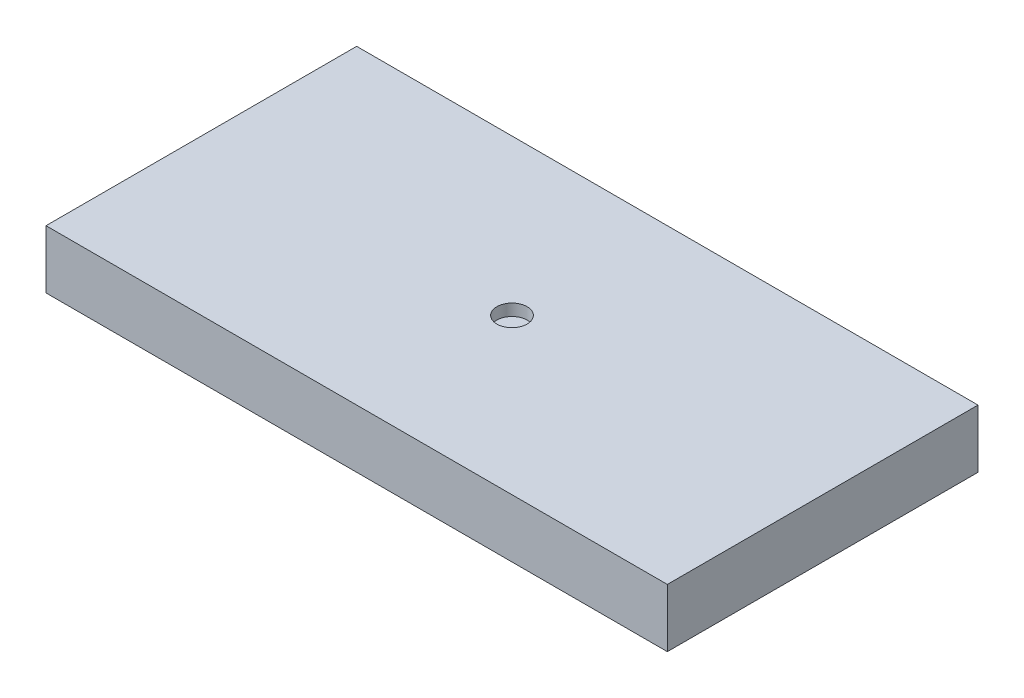
ISO-10303-21;
HEADER;
FILE_DESCRIPTION(('STEP AP214'),'2;1');
FILE_NAME('part.step','',(''),(''),'','','');
FILE_SCHEMA(('AUTOMOTIVE_DESIGN { 1 0 10303 214 1 1 1 1 }'));
ENDSEC;
DATA;
#1=APPLICATION_CONTEXT('core data for automotive mechanical design processes');
#2=APPLICATION_PROTOCOL_DEFINITION('international standard','automotive_design',2000,#1);
#3=PRODUCT_CONTEXT('',#1,'mechanical');
#4=PRODUCT('Part','Part','',(#3));
#5=PRODUCT_RELATED_PRODUCT_CATEGORY('part','',(#4));
#6=PRODUCT_DEFINITION_FORMATION('','',#4);
#7=PRODUCT_DEFINITION_CONTEXT('part definition',#1,'design');
#8=PRODUCT_DEFINITION('design','',#6,#7);
#9=PRODUCT_DEFINITION_SHAPE('','',#8);
#10=(LENGTH_UNIT() NAMED_UNIT(*) SI_UNIT(.MILLI.,.METRE.));
#11=(NAMED_UNIT(*) PLANE_ANGLE_UNIT() SI_UNIT($,.RADIAN.));
#12=(NAMED_UNIT(*) SI_UNIT($,.STERADIAN.) SOLID_ANGLE_UNIT());
#13=UNCERTAINTY_MEASURE_WITH_UNIT(LENGTH_MEASURE(1.E-05),#10,'distance_accuracy_value','');
#14=(GEOMETRIC_REPRESENTATION_CONTEXT(3) GLOBAL_UNCERTAINTY_ASSIGNED_CONTEXT((#13)) GLOBAL_UNIT_ASSIGNED_CONTEXT((#10,
#11,#12)) REPRESENTATION_CONTEXT('',''));
#15=CARTESIAN_POINT('',(0.,0.,0.));
#16=DIRECTION('',(0.,0.,1.));
#17=DIRECTION('',(1.,0.,0.));
#18=AXIS2_PLACEMENT_3D('',#15,#16,#17);
#19=CARTESIAN_POINT('',(20.32,3.81,10.16));
#20=DIRECTION('',(-1.,0.,0.));
#21=DIRECTION('',(0.,0.,1.));
#22=AXIS2_PLACEMENT_3D('',#19,#20,#21);
#23=PLANE('',#22);
#24=DIRECTION('',(0.,0.,-1.));
#25=VECTOR('',#24,1.);
#26=CARTESIAN_POINT('',(20.32,0.,10.16));
#27=LINE('',#26,#25);
#28=CARTESIAN_POINT('',(20.32,0.,10.16));
#29=VERTEX_POINT('',#28);
#30=CARTESIAN_POINT('',(20.32,0.,-10.16));
#31=VERTEX_POINT('',#30);
#32=EDGE_CURVE('E98',#29,#31,#27,.T.);
#33=ORIENTED_EDGE('',*,*,#32,.T.);
#34=DIRECTION('',(0.,-1.,0.));
#35=VECTOR('',#34,1.);
#36=CARTESIAN_POINT('',(20.32,3.81,-10.16));
#37=LINE('',#36,#35);
#38=CARTESIAN_POINT('',(20.32,3.81,-10.16));
#39=VERTEX_POINT('',#38);
#40=EDGE_CURVE('E11',#39,#31,#37,.T.);
#41=ORIENTED_EDGE('',*,*,#40,.F.);
#42=DIRECTION('',(0.,0.,-1.));
#43=VECTOR('',#42,1.);
#44=CARTESIAN_POINT('',(20.32,3.81,10.16));
#45=LINE('',#44,#43);
#46=CARTESIAN_POINT('',(20.32,3.81,10.16));
#47=VERTEX_POINT('',#46);
#48=EDGE_CURVE('E86',#47,#39,#45,.T.);
#49=ORIENTED_EDGE('',*,*,#48,.F.);
#50=DIRECTION('',(0.,-1.,0.));
#51=VECTOR('',#50,1.);
#52=CARTESIAN_POINT('',(20.32,3.81,10.16));
#53=LINE('',#52,#51);
#54=EDGE_CURVE('E94',#47,#29,#53,.T.);
#55=ORIENTED_EDGE('',*,*,#54,.T.);
#56=EDGE_LOOP('',(#33,#41,#49,#55));
#57=FACE_BOUND('',#56,.T.);
#58=ADVANCED_FACE('F35',(#57),#23,.F.);
#59=CARTESIAN_POINT('',(-20.32,3.81,-10.16));
#60=DIRECTION('',(0.,0.,1.));
#61=DIRECTION('',(1.,0.,0.));
#62=AXIS2_PLACEMENT_3D('',#59,#60,#61);
#63=PLANE('',#62);
#64=DIRECTION('',(-1.,0.,0.));
#65=VECTOR('',#64,1.);
#66=CARTESIAN_POINT('',(-20.32,0.,-10.16));
#67=LINE('',#66,#65);
#68=CARTESIAN_POINT('',(-20.32,0.,-10.16));
#69=VERTEX_POINT('',#68);
#70=EDGE_CURVE('E90',#31,#69,#67,.T.);
#71=ORIENTED_EDGE('',*,*,#70,.T.);
#72=DIRECTION('',(0.,-1.,0.));
#73=VECTOR('',#72,1.);
#74=CARTESIAN_POINT('',(-20.32,3.81,-10.16));
#75=LINE('',#74,#73);
#76=CARTESIAN_POINT('',(-20.32,3.81,-10.16));
#77=VERTEX_POINT('',#76);
#78=EDGE_CURVE('E43',#77,#69,#75,.T.);
#79=ORIENTED_EDGE('',*,*,#78,.F.);
#80=DIRECTION('',(-1.,0.,0.));
#81=VECTOR('',#80,1.);
#82=CARTESIAN_POINT('',(-20.32,3.81,-10.16));
#83=LINE('',#82,#81);
#84=EDGE_CURVE('E81',#39,#77,#83,.T.);
#85=ORIENTED_EDGE('',*,*,#84,.F.);
#86=ORIENTED_EDGE('',*,*,#40,.T.);
#87=EDGE_LOOP('',(#71,#79,#85,#86));
#88=FACE_BOUND('',#87,.T.);
#89=ADVANCED_FACE('F89',(#88),#63,.F.);
#90=CARTESIAN_POINT('',(-20.32,3.81,10.16));
#91=DIRECTION('',(1.,0.,0.));
#92=DIRECTION('',(0.,0.,-1.));
#93=AXIS2_PLACEMENT_3D('',#90,#91,#92);
#94=PLANE('',#93);
#95=DIRECTION('',(0.,0.,1.));
#96=VECTOR('',#95,1.);
#97=CARTESIAN_POINT('',(-20.32,0.,10.16));
#98=LINE('',#97,#96);
#99=CARTESIAN_POINT('',(-20.32,0.,10.16));
#100=VERTEX_POINT('',#99);
#101=EDGE_CURVE('E68',#69,#100,#98,.T.);
#102=ORIENTED_EDGE('',*,*,#101,.T.);
#103=DIRECTION('',(0.,-1.,0.));
#104=VECTOR('',#103,1.);
#105=CARTESIAN_POINT('',(-20.32,3.81,10.16));
#106=LINE('',#105,#104);
#107=CARTESIAN_POINT('',(-20.32,3.81,10.16));
#108=VERTEX_POINT('',#107);
#109=EDGE_CURVE('E91',#108,#100,#106,.T.);
#110=ORIENTED_EDGE('',*,*,#109,.F.);
#111=DIRECTION('',(0.,0.,1.));
#112=VECTOR('',#111,1.);
#113=CARTESIAN_POINT('',(-20.32,3.81,10.16));
#114=LINE('',#113,#112);
#115=EDGE_CURVE('E84',#77,#108,#114,.T.);
#116=ORIENTED_EDGE('',*,*,#115,.F.);
#117=ORIENTED_EDGE('',*,*,#78,.T.);
#118=EDGE_LOOP('',(#102,#110,#116,#117));
#119=FACE_BOUND('',#118,.T.);
#120=ADVANCED_FACE('F92',(#119),#94,.F.);
#121=CARTESIAN_POINT('',(-20.32,3.81,10.16));
#122=DIRECTION('',(0.,0.,-1.));
#123=DIRECTION('',(-1.,0.,0.));
#124=AXIS2_PLACEMENT_3D('',#121,#122,#123);
#125=PLANE('',#124);
#126=DIRECTION('',(1.,0.,0.));
#127=VECTOR('',#126,1.);
#128=CARTESIAN_POINT('',(-20.32,0.,10.16));
#129=LINE('',#128,#127);
#130=EDGE_CURVE('E74',#100,#29,#129,.T.);
#131=ORIENTED_EDGE('',*,*,#130,.T.);
#132=ORIENTED_EDGE('',*,*,#54,.F.);
#133=DIRECTION('',(1.,0.,0.));
#134=VECTOR('',#133,1.);
#135=CARTESIAN_POINT('',(-20.32,3.81,10.16));
#136=LINE('',#135,#134);
#137=EDGE_CURVE('E51',#108,#47,#136,.T.);
#138=ORIENTED_EDGE('',*,*,#137,.F.);
#139=ORIENTED_EDGE('',*,*,#109,.T.);
#140=EDGE_LOOP('',(#131,#132,#138,#139));
#141=FACE_BOUND('',#140,.T.);
#142=ADVANCED_FACE('F106',(#141),#125,.F.);
#143=CARTESIAN_POINT('',(0.,3.81,0.));
#144=DIRECTION('',(0.,-1.,0.));
#145=DIRECTION('',(0.,0.,-1.));
#146=AXIS2_PLACEMENT_3D('',#143,#144,#145);
#147=PLANE('',#146);
#148=CARTESIAN_POINT('',(0.,3.81,0.));
#149=DIRECTION('',(0.,1.,0.));
#150=DIRECTION('',(0.,0.,1.));
#151=AXIS2_PLACEMENT_3D('',#148,#149,#150);
#152=CIRCLE('',#151,0.988166538320456);
#153=CARTESIAN_POINT('',(0.,3.81,0.988166538320456));
#154=VERTEX_POINT('',#153);
#155=EDGE_CURVE('E112',#154,#154,#152,.T.);
#156=ORIENTED_EDGE('',*,*,#155,.F.);
#157=EDGE_LOOP('',(#156));
#158=FACE_BOUND('',#157,.T.);
#159=ORIENTED_EDGE('',*,*,#48,.T.);
#160=ORIENTED_EDGE('',*,*,#84,.T.);
#161=ORIENTED_EDGE('',*,*,#115,.T.);
#162=ORIENTED_EDGE('',*,*,#137,.T.);
#163=EDGE_LOOP('',(#159,#160,#161,#162));
#164=FACE_BOUND('',#163,.T.);
#165=ADVANCED_FACE('F82',(#158,#164),#147,.F.);
#166=CARTESIAN_POINT('',(0.,0.,0.));
#167=DIRECTION('',(0.,-1.,0.));
#168=DIRECTION('',(0.,0.,-1.));
#169=AXIS2_PLACEMENT_3D('',#166,#167,#168);
#170=PLANE('',#169);
#171=ORIENTED_EDGE('',*,*,#32,.F.);
#172=ORIENTED_EDGE('',*,*,#130,.F.);
#173=ORIENTED_EDGE('',*,*,#101,.F.);
#174=ORIENTED_EDGE('',*,*,#70,.F.);
#175=EDGE_LOOP('',(#171,#172,#173,#174));
#176=FACE_BOUND('',#175,.T.);
#177=ADVANCED_FACE('F109',(#176),#170,.T.);
#178=CARTESIAN_POINT('',(0.,3.048,0.));
#179=DIRECTION('',(0.,1.,0.));
#180=DIRECTION('',(0.,0.,1.));
#181=AXIS2_PLACEMENT_3D('',#178,#179,#180);
#182=CYLINDRICAL_SURFACE('',#181,0.988166538320456);
#183=CARTESIAN_POINT('',(0.,3.048,0.));
#184=DIRECTION('',(0.,1.,0.));
#185=DIRECTION('',(0.,0.,1.));
#186=AXIS2_PLACEMENT_3D('',#183,#184,#185);
#187=CIRCLE('',#186,0.988166538320456);
#188=CARTESIAN_POINT('',(0.,3.048,0.988166538320456));
#189=VERTEX_POINT('',#188);
#190=EDGE_CURVE('E101',#189,#189,#187,.T.);
#191=ORIENTED_EDGE('',*,*,#190,.F.);
#192=EDGE_LOOP('',(#191));
#193=FACE_BOUND('',#192,.T.);
#194=ORIENTED_EDGE('',*,*,#155,.T.);
#195=EDGE_LOOP('',(#194));
#196=FACE_BOUND('',#195,.T.);
#197=ADVANCED_FACE('F120',(#193,#196),#182,.F.);
#198=CARTESIAN_POINT('',(0.,3.048,0.));
#199=DIRECTION('',(0.,1.,0.));
#200=DIRECTION('',(0.,0.,1.));
#201=AXIS2_PLACEMENT_3D('',#198,#199,#200);
#202=PLANE('',#201);
#203=ORIENTED_EDGE('',*,*,#190,.T.);
#204=EDGE_LOOP('',(#203));
#205=FACE_BOUND('',#204,.T.);
#206=ADVANCED_FACE('F118',(#205),#202,.T.);
#207=CLOSED_SHELL('',(#58,#89,#120,#142,#165,#177,#197,#206));
#208=MANIFOLD_SOLID_BREP('B2',#207);
#209=ADVANCED_BREP_SHAPE_REPRESENTATION('',(#18,#208),#14);
#210=SHAPE_DEFINITION_REPRESENTATION(#9,#209);
ENDSEC;
END-ISO-10303-21;
